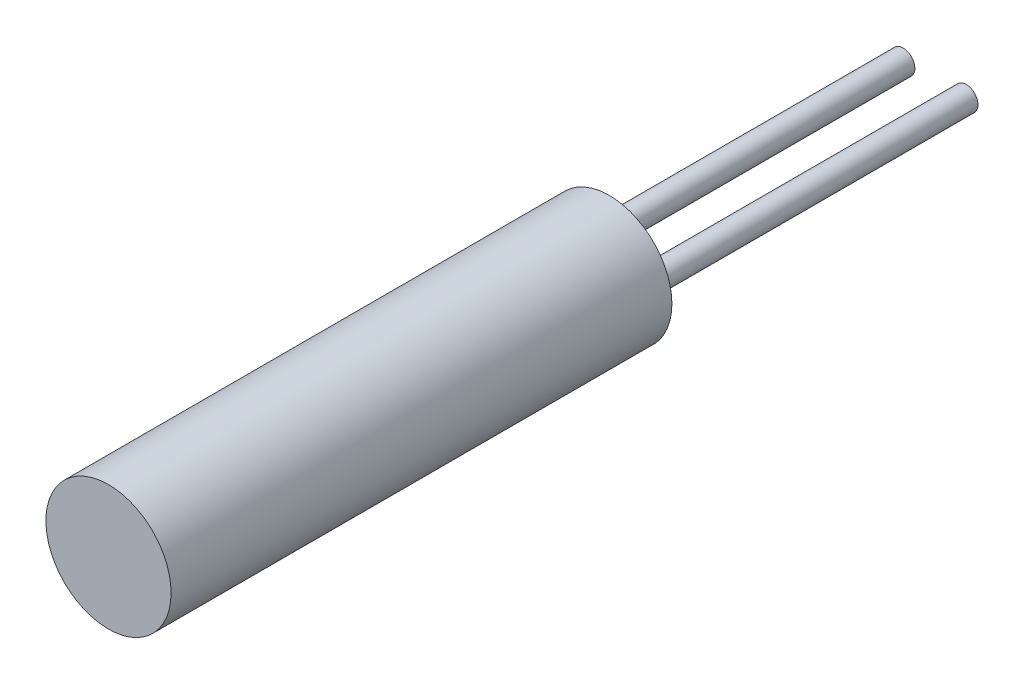
ISO-10303-21;
HEADER;
FILE_DESCRIPTION(('STEP AP214'),'2;1');
FILE_NAME('part.step','',(''),(''),'','','');
FILE_SCHEMA(('AUTOMOTIVE_DESIGN { 1 0 10303 214 1 1 1 1 }'));
ENDSEC;
DATA;
#1=APPLICATION_CONTEXT('core data for automotive mechanical design processes');
#2=APPLICATION_PROTOCOL_DEFINITION('international standard','automotive_design',2000,#1);
#3=PRODUCT_CONTEXT('',#1,'mechanical');
#4=PRODUCT('Part','Part','',(#3));
#5=PRODUCT_RELATED_PRODUCT_CATEGORY('part','',(#4));
#6=PRODUCT_DEFINITION_FORMATION('','',#4);
#7=PRODUCT_DEFINITION_CONTEXT('part definition',#1,'design');
#8=PRODUCT_DEFINITION('design','',#6,#7);
#9=PRODUCT_DEFINITION_SHAPE('','',#8);
#10=(LENGTH_UNIT() NAMED_UNIT(*) SI_UNIT(.MILLI.,.METRE.));
#11=(NAMED_UNIT(*) PLANE_ANGLE_UNIT() SI_UNIT($,.RADIAN.));
#12=(NAMED_UNIT(*) SI_UNIT($,.STERADIAN.) SOLID_ANGLE_UNIT());
#13=UNCERTAINTY_MEASURE_WITH_UNIT(LENGTH_MEASURE(1.E-05),#10,'distance_accuracy_value','');
#14=(GEOMETRIC_REPRESENTATION_CONTEXT(3) GLOBAL_UNCERTAINTY_ASSIGNED_CONTEXT((#13)) GLOBAL_UNIT_ASSIGNED_CONTEXT((#10,
#11,#12)) REPRESENTATION_CONTEXT('',''));
#15=CARTESIAN_POINT('',(0.,0.,0.));
#16=DIRECTION('',(0.,0.,1.));
#17=DIRECTION('',(1.,0.,0.));
#18=AXIS2_PLACEMENT_3D('',#15,#16,#17);
#19=CARTESIAN_POINT('',(0.,0.,0.));
#20=DIRECTION('',(0.,0.,1.));
#21=DIRECTION('',(1.,0.,0.));
#22=AXIS2_PLACEMENT_3D('',#19,#20,#21);
#23=PLANE('',#22);
#24=CARTESIAN_POINT('',(1.6,0.,0.));
#25=DIRECTION('',(0.,0.,1.));
#26=DIRECTION('',(1.,0.,0.));
#27=AXIS2_PLACEMENT_3D('',#24,#25,#26);
#28=CIRCLE('',#27,0.6);
#29=CARTESIAN_POINT('',(2.2,0.,0.));
#30=VERTEX_POINT('',#29);
#31=EDGE_CURVE('E41',#30,#30,#28,.F.);
#32=ORIENTED_EDGE('',*,*,#31,.F.);
#33=EDGE_LOOP('',(#32));
#34=FACE_BOUND('',#33,.T.);
#35=CARTESIAN_POINT('',(0.,0.,0.));
#36=DIRECTION('',(0.,0.,1.));
#37=DIRECTION('',(1.,0.,0.));
#38=AXIS2_PLACEMENT_3D('',#35,#36,#37);
#39=CIRCLE('',#38,3.175);
#40=CARTESIAN_POINT('',(3.175,0.,0.));
#41=VERTEX_POINT('',#40);
#42=EDGE_CURVE('E49',#41,#41,#39,.T.);
#43=ORIENTED_EDGE('',*,*,#42,.F.);
#44=EDGE_LOOP('',(#43));
#45=FACE_BOUND('',#44,.T.);
#46=CARTESIAN_POINT('',(-1.6,0.,0.));
#47=DIRECTION('',(0.,0.,1.));
#48=DIRECTION('',(1.,0.,0.));
#49=AXIS2_PLACEMENT_3D('',#46,#47,#48);
#50=CIRCLE('',#49,0.6);
#51=CARTESIAN_POINT('',(-1.,0.,0.));
#52=VERTEX_POINT('',#51);
#53=EDGE_CURVE('E10',#52,#52,#50,.F.);
#54=ORIENTED_EDGE('',*,*,#53,.F.);
#55=EDGE_LOOP('',(#54));
#56=FACE_BOUND('',#55,.T.);
#57=ADVANCED_FACE('F34',(#34,#45,#56),#23,.F.);
#58=CARTESIAN_POINT('',(0.,0.,25.4));
#59=DIRECTION('',(0.,0.,-1.));
#60=DIRECTION('',(-1.,0.,0.));
#61=AXIS2_PLACEMENT_3D('',#58,#59,#60);
#62=CYLINDRICAL_SURFACE('',#61,3.175);
#63=CARTESIAN_POINT('',(0.,0.,25.4));
#64=DIRECTION('',(0.,0.,1.));
#65=DIRECTION('',(1.,0.,0.));
#66=AXIS2_PLACEMENT_3D('',#63,#64,#65);
#67=CIRCLE('',#66,3.175);
#68=CARTESIAN_POINT('',(3.175,0.,25.4));
#69=VERTEX_POINT('',#68);
#70=EDGE_CURVE('E45',#69,#69,#67,.T.);
#71=ORIENTED_EDGE('',*,*,#70,.F.);
#72=EDGE_LOOP('',(#71));
#73=FACE_BOUND('',#72,.T.);
#74=ORIENTED_EDGE('',*,*,#42,.T.);
#75=EDGE_LOOP('',(#74));
#76=FACE_BOUND('',#75,.T.);
#77=ADVANCED_FACE('F36',(#73,#76),#62,.T.);
#78=CARTESIAN_POINT('',(0.,0.,25.4));
#79=DIRECTION('',(0.,0.,1.));
#80=DIRECTION('',(1.,0.,0.));
#81=AXIS2_PLACEMENT_3D('',#78,#79,#80);
#82=PLANE('',#81);
#83=ORIENTED_EDGE('',*,*,#70,.T.);
#84=EDGE_LOOP('',(#83));
#85=FACE_BOUND('',#84,.T.);
#86=ADVANCED_FACE('F80',(#85),#82,.T.);
#87=CARTESIAN_POINT('',(1.6,0.,-16.5));
#88=DIRECTION('',(0.,0.,1.));
#89=DIRECTION('',(1.,0.,0.));
#90=AXIS2_PLACEMENT_3D('',#87,#88,#89);
#91=CYLINDRICAL_SURFACE('',#90,0.6);
#92=CARTESIAN_POINT('',(1.6,0.,-16.5));
#93=DIRECTION('',(0.,0.,-1.));
#94=DIRECTION('',(-1.,0.,0.));
#95=AXIS2_PLACEMENT_3D('',#92,#93,#94);
#96=CIRCLE('',#95,0.6);
#97=CARTESIAN_POINT('',(1.,0.,-16.5));
#98=VERTEX_POINT('',#97);
#99=EDGE_CURVE('E53',#98,#98,#96,.T.);
#100=ORIENTED_EDGE('',*,*,#99,.F.);
#101=EDGE_LOOP('',(#100));
#102=FACE_BOUND('',#101,.T.);
#103=ORIENTED_EDGE('',*,*,#31,.T.);
#104=EDGE_LOOP('',(#103));
#105=FACE_BOUND('',#104,.T.);
#106=ADVANCED_FACE('F72',(#102,#105),#91,.T.);
#107=CARTESIAN_POINT('',(1.6,0.,-16.5));
#108=DIRECTION('',(0.,0.,-1.));
#109=DIRECTION('',(-1.,0.,0.));
#110=AXIS2_PLACEMENT_3D('',#107,#108,#109);
#111=PLANE('',#110);
#112=ORIENTED_EDGE('',*,*,#99,.T.);
#113=EDGE_LOOP('',(#112));
#114=FACE_BOUND('',#113,.T.);
#115=ADVANCED_FACE('F65',(#114),#111,.T.);
#116=CARTESIAN_POINT('',(-1.6,0.,-16.5));
#117=DIRECTION('',(0.,0.,1.));
#118=DIRECTION('',(1.,0.,0.));
#119=AXIS2_PLACEMENT_3D('',#116,#117,#118);
#120=CYLINDRICAL_SURFACE('',#119,0.6);
#121=CARTESIAN_POINT('',(-1.6,0.,-16.5));
#122=DIRECTION('',(0.,0.,-1.));
#123=DIRECTION('',(-1.,0.,0.));
#124=AXIS2_PLACEMENT_3D('',#121,#122,#123);
#125=CIRCLE('',#124,0.6);
#126=CARTESIAN_POINT('',(-2.2,0.,-16.5));
#127=VERTEX_POINT('',#126);
#128=EDGE_CURVE('E57',#127,#127,#125,.T.);
#129=ORIENTED_EDGE('',*,*,#128,.F.);
#130=EDGE_LOOP('',(#129));
#131=FACE_BOUND('',#130,.T.);
#132=ORIENTED_EDGE('',*,*,#53,.T.);
#133=EDGE_LOOP('',(#132));
#134=FACE_BOUND('',#133,.T.);
#135=ADVANCED_FACE('F63',(#131,#134),#120,.T.);
#136=CARTESIAN_POINT('',(-1.6,0.,-16.5));
#137=DIRECTION('',(0.,0.,-1.));
#138=DIRECTION('',(-1.,0.,0.));
#139=AXIS2_PLACEMENT_3D('',#136,#137,#138);
#140=PLANE('',#139);
#141=ORIENTED_EDGE('',*,*,#128,.T.);
#142=EDGE_LOOP('',(#141));
#143=FACE_BOUND('',#142,.T.);
#144=ADVANCED_FACE('F61',(#143),#140,.T.);
#145=CLOSED_SHELL('',(#57,#77,#86,#106,#115,#135,#144));
#146=MANIFOLD_SOLID_BREP('B2',#145);
#147=ADVANCED_BREP_SHAPE_REPRESENTATION('',(#18,#146),#14);
#148=SHAPE_DEFINITION_REPRESENTATION(#9,#147);
ENDSEC;
END-ISO-10303-21;
